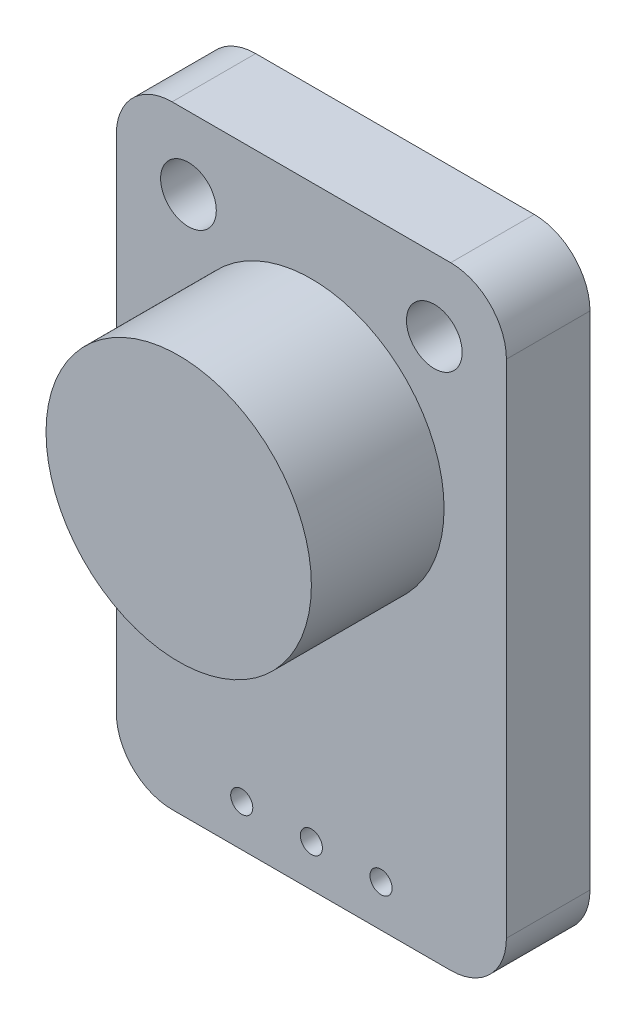
ISO-10303-21;
HEADER;
FILE_DESCRIPTION(('STEP AP214'),'2;1');
FILE_NAME('part.step','',(''),(''),'','','');
FILE_SCHEMA(('AUTOMOTIVE_DESIGN { 1 0 10303 214 1 1 1 1 }'));
ENDSEC;
DATA;
#1=APPLICATION_CONTEXT('core data for automotive mechanical design processes');
#2=APPLICATION_PROTOCOL_DEFINITION('international standard','automotive_design',2000,#1);
#3=PRODUCT_CONTEXT('',#1,'mechanical');
#4=PRODUCT('Part','Part','',(#3));
#5=PRODUCT_RELATED_PRODUCT_CATEGORY('part','',(#4));
#6=PRODUCT_DEFINITION_FORMATION('','',#4);
#7=PRODUCT_DEFINITION_CONTEXT('part definition',#1,'design');
#8=PRODUCT_DEFINITION('design','',#6,#7);
#9=PRODUCT_DEFINITION_SHAPE('','',#8);
#10=(LENGTH_UNIT() NAMED_UNIT(*) SI_UNIT(.MILLI.,.METRE.));
#11=(NAMED_UNIT(*) PLANE_ANGLE_UNIT() SI_UNIT($,.RADIAN.));
#12=(NAMED_UNIT(*) SI_UNIT($,.STERADIAN.) SOLID_ANGLE_UNIT());
#13=UNCERTAINTY_MEASURE_WITH_UNIT(LENGTH_MEASURE(1.E-05),#10,'distance_accuracy_value','');
#14=(GEOMETRIC_REPRESENTATION_CONTEXT(3) GLOBAL_UNCERTAINTY_ASSIGNED_CONTEXT((#13)) GLOBAL_UNIT_ASSIGNED_CONTEXT((#10,
#11,#12)) REPRESENTATION_CONTEXT('',''));
#15=CARTESIAN_POINT('',(0.,0.,0.));
#16=DIRECTION('',(0.,0.,1.));
#17=DIRECTION('',(1.,0.,0.));
#18=AXIS2_PLACEMENT_3D('',#15,#16,#17);
#19=CARTESIAN_POINT('',(0.,0.,4.7625));
#20=DIRECTION('',(0.,0.,-1.));
#21=DIRECTION('',(-1.,0.,0.));
#22=AXIS2_PLACEMENT_3D('',#19,#20,#21);
#23=CYLINDRICAL_SURFACE('',#22,4.7625);
#24=CARTESIAN_POINT('',(0.,0.,4.7625));
#25=DIRECTION('',(0.,0.,1.));
#26=DIRECTION('',(1.,0.,0.));
#27=AXIS2_PLACEMENT_3D('',#24,#25,#26);
#28=CIRCLE('',#27,4.7625);
#29=CARTESIAN_POINT('',(-4.7625,0.,4.7625));
#30=VERTEX_POINT('',#29);
#31=EDGE_CURVE('E160',#30,#30,#28,.T.);
#32=CARTESIAN_POINT('',(0.,0.,0.));
#33=DIRECTION('',(0.,0.,1.));
#34=DIRECTION('',(1.,0.,0.));
#35=AXIS2_PLACEMENT_3D('',#32,#33,#34);
#36=CIRCLE('',#35,4.7625);
#37=CARTESIAN_POINT('',(-4.7625,0.,0.));
#38=VERTEX_POINT('',#37);
#39=EDGE_CURVE('E164',#38,#38,#36,.T.);
#40=CARTESIAN_POINT('',(-4.7625,0.,4.7625));
#41=CARTESIAN_POINT('',(-4.7625,0.,4.712890625));
#42=CARTESIAN_POINT('',(-4.7625,0.,4.66328125));
#43=CARTESIAN_POINT('',(-4.7625,0.,4.5640625));
#44=CARTESIAN_POINT('',(-4.7625,0.,4.514453125));
#45=CARTESIAN_POINT('',(-4.7625,0.,4.415234375));
#46=CARTESIAN_POINT('',(-4.7625,0.,4.365625));
#47=CARTESIAN_POINT('',(-4.7625,0.,4.26640625));
#48=CARTESIAN_POINT('',(-4.7625,0.,4.216796875));
#49=CARTESIAN_POINT('',(-4.7625,0.,4.117578125));
#50=CARTESIAN_POINT('',(-4.7625,0.,4.06796875));
#51=CARTESIAN_POINT('',(-4.7625,0.,3.96875));
#52=CARTESIAN_POINT('',(-4.7625,0.,3.919140625));
#53=CARTESIAN_POINT('',(-4.7625,0.,3.819921875));
#54=CARTESIAN_POINT('',(-4.7625,0.,3.7703125));
#55=CARTESIAN_POINT('',(-4.7625,0.,3.67109375));
#56=CARTESIAN_POINT('',(-4.7625,0.,3.621484375));
#57=CARTESIAN_POINT('',(-4.7625,0.,3.522265625));
#58=CARTESIAN_POINT('',(-4.7625,0.,3.47265625));
#59=CARTESIAN_POINT('',(-4.7625,0.,3.3734375));
#60=CARTESIAN_POINT('',(-4.7625,0.,3.323828125));
#61=CARTESIAN_POINT('',(-4.7625,0.,3.224609375));
#62=CARTESIAN_POINT('',(-4.7625,0.,3.175));
#63=CARTESIAN_POINT('',(-4.7625,0.,3.07578125));
#64=CARTESIAN_POINT('',(-4.7625,0.,3.026171875));
#65=CARTESIAN_POINT('',(-4.7625,0.,2.926953125));
#66=CARTESIAN_POINT('',(-4.7625,0.,2.87734375));
#67=CARTESIAN_POINT('',(-4.7625,0.,2.778125));
#68=CARTESIAN_POINT('',(-4.7625,0.,2.728515625));
#69=CARTESIAN_POINT('',(-4.7625,0.,2.629296875));
#70=CARTESIAN_POINT('',(-4.7625,0.,2.5796875));
#71=CARTESIAN_POINT('',(-4.7625,0.,2.48046875));
#72=CARTESIAN_POINT('',(-4.7625,0.,2.430859375));
#73=CARTESIAN_POINT('',(-4.7625,0.,2.331640625));
#74=CARTESIAN_POINT('',(-4.7625,0.,2.28203125));
#75=CARTESIAN_POINT('',(-4.7625,0.,2.1828125));
#76=CARTESIAN_POINT('',(-4.7625,0.,2.133203125));
#77=CARTESIAN_POINT('',(-4.7625,0.,2.033984375));
#78=CARTESIAN_POINT('',(-4.7625,0.,1.984375));
#79=CARTESIAN_POINT('',(-4.7625,0.,1.88515625));
#80=CARTESIAN_POINT('',(-4.7625,0.,1.835546875));
#81=CARTESIAN_POINT('',(-4.7625,0.,1.736328125));
#82=CARTESIAN_POINT('',(-4.7625,0.,1.68671875));
#83=CARTESIAN_POINT('',(-4.7625,0.,1.5875));
#84=CARTESIAN_POINT('',(-4.7625,0.,1.537890625));
#85=CARTESIAN_POINT('',(-4.7625,0.,1.438671875));
#86=CARTESIAN_POINT('',(-4.7625,0.,1.3890625));
#87=CARTESIAN_POINT('',(-4.7625,0.,1.28984375));
#88=CARTESIAN_POINT('',(-4.7625,0.,1.240234375));
#89=CARTESIAN_POINT('',(-4.7625,0.,1.141015625));
#90=CARTESIAN_POINT('',(-4.7625,0.,1.09140625));
#91=CARTESIAN_POINT('',(-4.7625,0.,0.992187499999999));
#92=CARTESIAN_POINT('',(-4.7625,0.,0.942578124999999));
#93=CARTESIAN_POINT('',(-4.7625,0.,0.843359375));
#94=CARTESIAN_POINT('',(-4.7625,0.,0.79375));
#95=CARTESIAN_POINT('',(-4.7625,0.,0.69453125));
#96=CARTESIAN_POINT('',(-4.7625,0.,0.644921875));
#97=CARTESIAN_POINT('',(-4.7625,0.,0.545703125));
#98=CARTESIAN_POINT('',(-4.7625,0.,0.49609375));
#99=CARTESIAN_POINT('',(-4.7625,0.,0.396875));
#100=CARTESIAN_POINT('',(-4.7625,0.,0.347265625));
#101=CARTESIAN_POINT('',(-4.7625,0.,0.248046875));
#102=CARTESIAN_POINT('',(-4.7625,0.,0.1984375));
#103=CARTESIAN_POINT('',(-4.7625,0.,0.09921875));
#104=CARTESIAN_POINT('',(-4.7625,0.,0.049609375));
#105=CARTESIAN_POINT('',(-4.7625,0.,0.));
#106=B_SPLINE_CURVE_WITH_KNOTS('',3,(#40,#41,#42,#43,#44,#45,#46,#47,#48,#49,#50,#51,#52,#53,
#54,#55,#56,#57,#58,#59,#60,#61,#62,#63,#64,#65,#66,#67,#68,#69,#70,#71,#72,#73,#74,#75,#76,#77,
#78,#79,#80,#81,#82,#83,#84,#85,#86,#87,#88,#89,#90,#91,#92,#93,#94,#95,#96,#97,#98,#99,#100,
#101,#102,#103,#104,#105),.UNSPECIFIED.,.F.,.F.,(4,2,2,2,2,2,2,2,2,2,2,2,2,2,2,2,2,2,2,2,2,2,2,
2,2,2,2,2,2,2,2,2,4),(0.,0.148828125,0.29765625,0.446484375,0.5953125,0.744140625,
0.892968750000001,1.041796875,1.190625,1.339453125,1.48828125,1.637109375,1.7859375,1.934765625,
2.08359375,2.232421875,2.38125,2.530078125,2.67890625,2.827734375,2.9765625,3.125390625,
3.27421875,3.423046875,3.571875,3.720703125,3.86953125,4.018359375,4.1671875,4.316015625,
4.46484375,4.613671875,4.7625),.UNSPECIFIED.);
#107=EDGE_CURVE('BSEAM50',#30,#38,#106,.T.);
#108=ORIENTED_EDGE('',*,*,#31,.F.);
#109=ORIENTED_EDGE('',*,*,#39,.T.);
#110=ORIENTED_EDGE('',*,*,#107,.T.);
#111=ORIENTED_EDGE('',*,*,#107,.F.);
#112=EDGE_LOOP('',(#108,#110,#109,#111));
#113=FACE_BOUND('',#112,.T.);
#114=ADVANCED_FACE('F50',(#113),#23,.T.);
#115=CARTESIAN_POINT('',(0.,0.,4.7625));
#116=DIRECTION('',(0.,0.,1.));
#117=DIRECTION('',(1.,0.,0.));
#118=AXIS2_PLACEMENT_3D('',#115,#116,#117);
#119=PLANE('',#118);
#120=ORIENTED_EDGE('',*,*,#31,.T.);
#121=EDGE_LOOP('',(#120));
#122=FACE_BOUND('',#121,.T.);
#123=ADVANCED_FACE('F276',(#122),#119,.T.);
#124=CARTESIAN_POINT('',(0.,-14.2375,-3.));
#125=DIRECTION('',(0.,-1.,0.));
#126=DIRECTION('',(0.,0.,-1.));
#127=AXIS2_PLACEMENT_3D('',#124,#125,#126);
#128=PLANE('',#127);
#129=DIRECTION('',(1.,0.,0.));
#130=VECTOR('',#129,1.);
#131=CARTESIAN_POINT('',(0.,-14.2375,0.));
#132=LINE('',#131,#130);
#133=CARTESIAN_POINT('',(-5.00000000000001,-14.2375,0.));
#134=VERTEX_POINT('',#133);
#135=CARTESIAN_POINT('',(4.99999999999999,-14.2375,0.));
#136=VERTEX_POINT('',#135);
#137=EDGE_CURVE('E222',#134,#136,#132,.T.);
#138=ORIENTED_EDGE('',*,*,#137,.F.);
#139=DIRECTION('',(0.,0.,1.));
#140=VECTOR('',#139,1.);
#141=CARTESIAN_POINT('',(-5.00000000000001,-14.2375,-3.));
#142=LINE('',#141,#140);
#143=CARTESIAN_POINT('',(-5.00000000000001,-14.2375,-3.));
#144=VERTEX_POINT('',#143);
#145=EDGE_CURVE('E123',#134,#144,#142,.F.);
#146=ORIENTED_EDGE('',*,*,#145,.T.);
#147=DIRECTION('',(1.,0.,0.));
#148=VECTOR('',#147,1.);
#149=CARTESIAN_POINT('',(0.,-14.2375,-3.));
#150=LINE('',#149,#148);
#151=CARTESIAN_POINT('',(4.99999999999999,-14.2375,-3.));
#152=VERTEX_POINT('',#151);
#153=EDGE_CURVE('E147',#144,#152,#150,.T.);
#154=ORIENTED_EDGE('',*,*,#153,.T.);
#155=DIRECTION('',(0.,0.,1.));
#156=VECTOR('',#155,1.);
#157=CARTESIAN_POINT('',(4.99999999999999,-14.2375,-3.));
#158=LINE('',#157,#156);
#159=EDGE_CURVE('E129',#152,#136,#158,.T.);
#160=ORIENTED_EDGE('',*,*,#159,.T.);
#161=EDGE_LOOP('',(#138,#146,#154,#160));
#162=FACE_BOUND('',#161,.T.);
#163=ADVANCED_FACE('F282',(#162),#128,.T.);
#164=CARTESIAN_POINT('',(-7.00000000000001,0.,-3.));
#165=DIRECTION('',(1.,0.,0.));
#166=DIRECTION('',(0.,0.,-1.));
#167=AXIS2_PLACEMENT_3D('',#164,#165,#166);
#168=PLANE('',#167);
#169=DIRECTION('',(0.,1.,0.));
#170=VECTOR('',#169,1.);
#171=CARTESIAN_POINT('',(-7.00000000000001,0.,-3.));
#172=LINE('',#171,#170);
#173=CARTESIAN_POINT('',(-7.00000000000001,-12.2375,-3.));
#174=VERTEX_POINT('',#173);
#175=CARTESIAN_POINT('',(-7.00000000000001,5.7625,-3.));
#176=VERTEX_POINT('',#175);
#177=EDGE_CURVE('E139',#174,#176,#172,.T.);
#178=ORIENTED_EDGE('',*,*,#177,.F.);
#179=DIRECTION('',(0.,0.,1.));
#180=VECTOR('',#179,1.);
#181=CARTESIAN_POINT('',(-7.00000000000001,-12.2375,0.));
#182=LINE('',#181,#180);
#183=CARTESIAN_POINT('',(-7.00000000000001,-12.2375,0.));
#184=VERTEX_POINT('',#183);
#185=EDGE_CURVE('E122',#174,#184,#182,.T.);
#186=ORIENTED_EDGE('',*,*,#185,.T.);
#187=DIRECTION('',(0.,1.,0.));
#188=VECTOR('',#187,1.);
#189=CARTESIAN_POINT('',(-7.00000000000001,0.,0.));
#190=LINE('',#189,#188);
#191=CARTESIAN_POINT('',(-7.00000000000001,5.7625,0.));
#192=VERTEX_POINT('',#191);
#193=EDGE_CURVE('E136',#184,#192,#190,.T.);
#194=ORIENTED_EDGE('',*,*,#193,.T.);
#195=DIRECTION('',(0.,0.,1.));
#196=VECTOR('',#195,1.);
#197=CARTESIAN_POINT('',(-7.00000000000001,5.7625,-3.));
#198=LINE('',#197,#196);
#199=EDGE_CURVE('E142',#192,#176,#198,.F.);
#200=ORIENTED_EDGE('',*,*,#199,.T.);
#201=EDGE_LOOP('',(#178,#186,#194,#200));
#202=FACE_BOUND('',#201,.T.);
#203=ADVANCED_FACE('F135',(#202),#168,.F.);
#204=CARTESIAN_POINT('',(0.,7.7625,-3.));
#205=DIRECTION('',(0.,-1.,0.));
#206=DIRECTION('',(0.,0.,-1.));
#207=AXIS2_PLACEMENT_3D('',#204,#205,#206);
#208=PLANE('',#207);
#209=DIRECTION('',(1.,0.,0.));
#210=VECTOR('',#209,1.);
#211=CARTESIAN_POINT('',(0.,7.7625,-3.));
#212=LINE('',#211,#210);
#213=CARTESIAN_POINT('',(-5.00000000000001,7.7625,-3.));
#214=VERTEX_POINT('',#213);
#215=CARTESIAN_POINT('',(5.,7.7625,-3.));
#216=VERTEX_POINT('',#215);
#217=EDGE_CURVE('E232',#214,#216,#212,.T.);
#218=ORIENTED_EDGE('',*,*,#217,.F.);
#219=DIRECTION('',(0.,0.,1.));
#220=VECTOR('',#219,1.);
#221=CARTESIAN_POINT('',(-5.00000000000001,7.7625,-3.));
#222=LINE('',#221,#220);
#223=CARTESIAN_POINT('',(-5.00000000000001,7.7625,0.));
#224=VERTEX_POINT('',#223);
#225=EDGE_CURVE('E196',#214,#224,#222,.T.);
#226=ORIENTED_EDGE('',*,*,#225,.T.);
#227=DIRECTION('',(1.,0.,0.));
#228=VECTOR('',#227,1.);
#229=CARTESIAN_POINT('',(0.,7.7625,0.));
#230=LINE('',#229,#228);
#231=CARTESIAN_POINT('',(5.,7.7625,0.));
#232=VERTEX_POINT('',#231);
#233=EDGE_CURVE('E148',#224,#232,#230,.T.);
#234=ORIENTED_EDGE('',*,*,#233,.T.);
#235=DIRECTION('',(0.,0.,1.));
#236=VECTOR('',#235,1.);
#237=CARTESIAN_POINT('',(5.,7.7625,-3.));
#238=LINE('',#237,#236);
#239=EDGE_CURVE('E193',#232,#216,#238,.F.);
#240=ORIENTED_EDGE('',*,*,#239,.T.);
#241=EDGE_LOOP('',(#218,#226,#234,#240));
#242=FACE_BOUND('',#241,.T.);
#243=ADVANCED_FACE('F310',(#242),#208,.F.);
#244=CARTESIAN_POINT('',(7.,0.,-3.));
#245=DIRECTION('',(1.,0.,0.));
#246=DIRECTION('',(0.,1.,0.));
#247=AXIS2_PLACEMENT_3D('',#244,#245,#246);
#248=PLANE('',#247);
#249=DIRECTION('',(0.,1.,0.));
#250=VECTOR('',#249,1.);
#251=CARTESIAN_POINT('',(7.,0.,0.));
#252=LINE('',#251,#250);
#253=CARTESIAN_POINT('',(6.99999999999999,-12.2375,0.));
#254=VERTEX_POINT('',#253);
#255=CARTESIAN_POINT('',(7.,5.7625,0.));
#256=VERTEX_POINT('',#255);
#257=EDGE_CURVE('E156',#254,#256,#252,.T.);
#258=ORIENTED_EDGE('',*,*,#257,.F.);
#259=DIRECTION('',(0.,0.,1.));
#260=VECTOR('',#259,1.);
#261=CARTESIAN_POINT('',(6.99999999999999,-12.2375,-3.));
#262=LINE('',#261,#260);
#263=CARTESIAN_POINT('',(6.99999999999999,-12.2375,-3.));
#264=VERTEX_POINT('',#263);
#265=EDGE_CURVE('E11',#254,#264,#262,.F.);
#266=ORIENTED_EDGE('',*,*,#265,.T.);
#267=DIRECTION('',(0.,1.,0.));
#268=VECTOR('',#267,1.);
#269=CARTESIAN_POINT('',(7.,0.,-3.));
#270=LINE('',#269,#268);
#271=CARTESIAN_POINT('',(7.,5.7625,-3.));
#272=VERTEX_POINT('',#271);
#273=EDGE_CURVE('E153',#264,#272,#270,.T.);
#274=ORIENTED_EDGE('',*,*,#273,.T.);
#275=DIRECTION('',(0.,0.,1.));
#276=VECTOR('',#275,1.);
#277=CARTESIAN_POINT('',(7.,5.7625,0.));
#278=LINE('',#277,#276);
#279=EDGE_CURVE('E60',#272,#256,#278,.T.);
#280=ORIENTED_EDGE('',*,*,#279,.T.);
#281=EDGE_LOOP('',(#258,#266,#274,#280));
#282=FACE_BOUND('',#281,.T.);
#283=ADVANCED_FACE('F313',(#282),#248,.T.);
#284=CARTESIAN_POINT('',(0.,0.,-3.));
#285=DIRECTION('',(0.,0.,1.));
#286=DIRECTION('',(1.,0.,0.));
#287=AXIS2_PLACEMENT_3D('',#284,#285,#286);
#288=PLANE('',#287);
#289=CARTESIAN_POINT('',(4.41250000000001,5.175,-3.));
#290=DIRECTION('',(0.,0.,1.));
#291=DIRECTION('',(1.,0.,0.));
#292=AXIS2_PLACEMENT_3D('',#289,#290,#291);
#293=CIRCLE('',#292,1.);
#294=CARTESIAN_POINT('',(5.41250000000001,5.175,-3.));
#295=VERTEX_POINT('',#294);
#296=EDGE_CURVE('E241',#295,#295,#293,.T.);
#297=ORIENTED_EDGE('',*,*,#296,.T.);
#298=EDGE_LOOP('',(#297));
#299=FACE_BOUND('',#298,.T.);
#300=CARTESIAN_POINT('',(-4.41250000000001,5.175,-3.));
#301=DIRECTION('',(0.,0.,1.));
#302=DIRECTION('',(1.,0.,0.));
#303=AXIS2_PLACEMENT_3D('',#300,#301,#302);
#304=CIRCLE('',#303,1.);
#305=CARTESIAN_POINT('',(-3.41250000000001,5.175,-3.));
#306=VERTEX_POINT('',#305);
#307=EDGE_CURVE('E245',#306,#306,#304,.T.);
#308=ORIENTED_EDGE('',*,*,#307,.T.);
#309=EDGE_LOOP('',(#308));
#310=FACE_BOUND('',#309,.T.);
#311=CARTESIAN_POINT('',(-2.5,-12.7375,-3.));
#312=DIRECTION('',(0.,0.,1.));
#313=DIRECTION('',(1.,0.,0.));
#314=AXIS2_PLACEMENT_3D('',#311,#312,#313);
#315=CIRCLE('',#314,0.396875);
#316=CARTESIAN_POINT('',(-2.103125,-12.7375,-3.));
#317=VERTEX_POINT('',#316);
#318=EDGE_CURVE('E249',#317,#317,#315,.T.);
#319=ORIENTED_EDGE('',*,*,#318,.T.);
#320=EDGE_LOOP('',(#319));
#321=FACE_BOUND('',#320,.T.);
#322=CARTESIAN_POINT('',(2.5,-12.7375,-3.));
#323=DIRECTION('',(0.,0.,1.));
#324=DIRECTION('',(1.,0.,0.));
#325=AXIS2_PLACEMENT_3D('',#322,#323,#324);
#326=CIRCLE('',#325,0.396875);
#327=CARTESIAN_POINT('',(2.896875,-12.7375,-3.));
#328=VERTEX_POINT('',#327);
#329=EDGE_CURVE('E240',#328,#328,#326,.T.);
#330=ORIENTED_EDGE('',*,*,#329,.T.);
#331=EDGE_LOOP('',(#330));
#332=FACE_BOUND('',#331,.T.);
#333=CARTESIAN_POINT('',(0.,-12.7375,-3.));
#334=DIRECTION('',(0.,0.,1.));
#335=DIRECTION('',(1.,0.,0.));
#336=AXIS2_PLACEMENT_3D('',#333,#334,#335);
#337=CIRCLE('',#336,0.396875);
#338=CARTESIAN_POINT('',(0.396875,-12.7375,-3.));
#339=VERTEX_POINT('',#338);
#340=EDGE_CURVE('E208',#339,#339,#337,.T.);
#341=ORIENTED_EDGE('',*,*,#340,.T.);
#342=EDGE_LOOP('',(#341));
#343=FACE_BOUND('',#342,.T.);
#344=ORIENTED_EDGE('',*,*,#153,.F.);
#345=CARTESIAN_POINT('',(-5.00000000000001,-12.2375,-3.));
#346=DIRECTION('',(0.,0.,1.));
#347=DIRECTION('',(1.,0.,0.));
#348=AXIS2_PLACEMENT_3D('',#345,#346,#347);
#349=CIRCLE('',#348,2.);
#350=EDGE_CURVE('E190',#144,#174,#349,.F.);
#351=ORIENTED_EDGE('',*,*,#350,.T.);
#352=ORIENTED_EDGE('',*,*,#177,.T.);
#353=CARTESIAN_POINT('',(-5.00000000000001,5.7625,-3.));
#354=DIRECTION('',(0.,0.,1.));
#355=DIRECTION('',(1.,0.,0.));
#356=AXIS2_PLACEMENT_3D('',#353,#354,#355);
#357=CIRCLE('',#356,2.);
#358=EDGE_CURVE('E187',#176,#214,#357,.F.);
#359=ORIENTED_EDGE('',*,*,#358,.T.);
#360=ORIENTED_EDGE('',*,*,#217,.T.);
#361=CARTESIAN_POINT('',(5.,5.7625,-3.));
#362=DIRECTION('',(0.,0.,1.));
#363=DIRECTION('',(1.,0.,0.));
#364=AXIS2_PLACEMENT_3D('',#361,#362,#363);
#365=CIRCLE('',#364,2.);
#366=EDGE_CURVE('E68',#216,#272,#365,.F.);
#367=ORIENTED_EDGE('',*,*,#366,.T.);
#368=ORIENTED_EDGE('',*,*,#273,.F.);
#369=CARTESIAN_POINT('',(4.99999999999999,-12.2375,-3.));
#370=DIRECTION('',(0.,0.,1.));
#371=DIRECTION('',(1.,0.,0.));
#372=AXIS2_PLACEMENT_3D('',#369,#370,#371);
#373=CIRCLE('',#372,2.);
#374=EDGE_CURVE('E184',#264,#152,#373,.F.);
#375=ORIENTED_EDGE('',*,*,#374,.T.);
#376=EDGE_LOOP('',(#344,#351,#352,#359,#360,#367,#368,#375));
#377=FACE_BOUND('',#376,.T.);
#378=ADVANCED_FACE('F257',(#299,#310,#321,#332,#343,#377),#288,.F.);
#379=CARTESIAN_POINT('',(0.,0.,0.));
#380=DIRECTION('',(0.,0.,1.));
#381=DIRECTION('',(1.,0.,0.));
#382=AXIS2_PLACEMENT_3D('',#379,#380,#381);
#383=PLANE('',#382);
#384=CARTESIAN_POINT('',(4.41250000000001,5.175,0.));
#385=DIRECTION('',(0.,0.,1.));
#386=DIRECTION('',(1.,0.,0.));
#387=AXIS2_PLACEMENT_3D('',#384,#385,#386);
#388=CIRCLE('',#387,1.);
#389=CARTESIAN_POINT('',(5.41250000000001,5.175,0.));
#390=VERTEX_POINT('',#389);
#391=EDGE_CURVE('E54',#390,#390,#388,.T.);
#392=ORIENTED_EDGE('',*,*,#391,.F.);
#393=EDGE_LOOP('',(#392));
#394=FACE_BOUND('',#393,.T.);
#395=CARTESIAN_POINT('',(-4.41250000000001,5.175,0.));
#396=DIRECTION('',(0.,0.,1.));
#397=DIRECTION('',(1.,0.,0.));
#398=AXIS2_PLACEMENT_3D('',#395,#396,#397);
#399=CIRCLE('',#398,1.);
#400=CARTESIAN_POINT('',(-3.41250000000001,5.175,0.));
#401=VERTEX_POINT('',#400);
#402=EDGE_CURVE('E215',#401,#401,#399,.T.);
#403=ORIENTED_EDGE('',*,*,#402,.F.);
#404=EDGE_LOOP('',(#403));
#405=FACE_BOUND('',#404,.T.);
#406=CARTESIAN_POINT('',(-2.5,-12.7375,0.));
#407=DIRECTION('',(0.,0.,1.));
#408=DIRECTION('',(1.,0.,0.));
#409=AXIS2_PLACEMENT_3D('',#406,#407,#408);
#410=CIRCLE('',#409,0.396875);
#411=CARTESIAN_POINT('',(-2.103125,-12.7375,0.));
#412=VERTEX_POINT('',#411);
#413=EDGE_CURVE('E212',#412,#412,#410,.T.);
#414=ORIENTED_EDGE('',*,*,#413,.F.);
#415=EDGE_LOOP('',(#414));
#416=FACE_BOUND('',#415,.T.);
#417=CARTESIAN_POINT('',(2.5,-12.7375,0.));
#418=DIRECTION('',(0.,0.,1.));
#419=DIRECTION('',(1.,0.,0.));
#420=AXIS2_PLACEMENT_3D('',#417,#418,#419);
#421=CIRCLE('',#420,0.396875);
#422=CARTESIAN_POINT('',(2.896875,-12.7375,0.));
#423=VERTEX_POINT('',#422);
#424=EDGE_CURVE('E207',#423,#423,#421,.T.);
#425=ORIENTED_EDGE('',*,*,#424,.F.);
#426=EDGE_LOOP('',(#425));
#427=FACE_BOUND('',#426,.T.);
#428=CARTESIAN_POINT('',(0.,-12.7375,0.));
#429=DIRECTION('',(0.,0.,1.));
#430=DIRECTION('',(1.,0.,0.));
#431=AXIS2_PLACEMENT_3D('',#428,#429,#430);
#432=CIRCLE('',#431,0.396875);
#433=CARTESIAN_POINT('',(0.396875,-12.7375,0.));
#434=VERTEX_POINT('',#433);
#435=EDGE_CURVE('E203',#434,#434,#432,.T.);
#436=ORIENTED_EDGE('',*,*,#435,.F.);
#437=EDGE_LOOP('',(#436));
#438=FACE_BOUND('',#437,.T.);
#439=ORIENTED_EDGE('',*,*,#39,.F.);
#440=EDGE_LOOP('',(#439));
#441=FACE_BOUND('',#440,.T.);
#442=ORIENTED_EDGE('',*,*,#193,.F.);
#443=CARTESIAN_POINT('',(-5.00000000000001,-12.2375,0.));
#444=DIRECTION('',(0.,0.,1.));
#445=DIRECTION('',(1.,0.,0.));
#446=AXIS2_PLACEMENT_3D('',#443,#444,#445);
#447=CIRCLE('',#446,2.);
#448=EDGE_CURVE('E118',#184,#134,#447,.T.);
#449=ORIENTED_EDGE('',*,*,#448,.T.);
#450=ORIENTED_EDGE('',*,*,#137,.T.);
#451=CARTESIAN_POINT('',(4.99999999999999,-12.2375,0.));
#452=DIRECTION('',(0.,0.,1.));
#453=DIRECTION('',(1.,0.,0.));
#454=AXIS2_PLACEMENT_3D('',#451,#452,#453);
#455=CIRCLE('',#454,2.);
#456=EDGE_CURVE('E172',#136,#254,#455,.T.);
#457=ORIENTED_EDGE('',*,*,#456,.T.);
#458=ORIENTED_EDGE('',*,*,#257,.T.);
#459=CARTESIAN_POINT('',(5.,5.7625,0.));
#460=DIRECTION('',(0.,0.,1.));
#461=DIRECTION('',(1.,0.,0.));
#462=AXIS2_PLACEMENT_3D('',#459,#460,#461);
#463=CIRCLE('',#462,2.);
#464=EDGE_CURVE('E141',#256,#232,#463,.T.);
#465=ORIENTED_EDGE('',*,*,#464,.T.);
#466=ORIENTED_EDGE('',*,*,#233,.F.);
#467=CARTESIAN_POINT('',(-5.00000000000001,5.7625,0.));
#468=DIRECTION('',(0.,0.,1.));
#469=DIRECTION('',(1.,0.,0.));
#470=AXIS2_PLACEMENT_3D('',#467,#468,#469);
#471=CIRCLE('',#470,2.);
#472=EDGE_CURVE('E130',#224,#192,#471,.T.);
#473=ORIENTED_EDGE('',*,*,#472,.T.);
#474=EDGE_LOOP('',(#442,#449,#450,#457,#458,#465,#466,#473));
#475=FACE_BOUND('',#474,.T.);
#476=ADVANCED_FACE('F144',(#394,#405,#416,#427,#438,#441,#475),#383,.T.);
#477=CARTESIAN_POINT('',(-5.00000000000001,-12.2375,-3.));
#478=DIRECTION('',(0.,0.,-1.));
#479=DIRECTION('',(-1.,0.,0.));
#480=AXIS2_PLACEMENT_3D('',#477,#478,#479);
#481=CYLINDRICAL_SURFACE('',#480,2.);
#482=ORIENTED_EDGE('',*,*,#350,.F.);
#483=ORIENTED_EDGE('',*,*,#145,.F.);
#484=ORIENTED_EDGE('',*,*,#448,.F.);
#485=ORIENTED_EDGE('',*,*,#185,.F.);
#486=EDGE_LOOP('',(#482,#483,#484,#485));
#487=FACE_BOUND('',#486,.T.);
#488=ADVANCED_FACE('F121',(#487),#481,.T.);
#489=CARTESIAN_POINT('',(-5.00000000000001,5.7625,-3.));
#490=DIRECTION('',(0.,0.,1.));
#491=DIRECTION('',(1.,0.,0.));
#492=AXIS2_PLACEMENT_3D('',#489,#490,#491);
#493=CYLINDRICAL_SURFACE('',#492,2.);
#494=ORIENTED_EDGE('',*,*,#358,.F.);
#495=ORIENTED_EDGE('',*,*,#199,.F.);
#496=ORIENTED_EDGE('',*,*,#472,.F.);
#497=ORIENTED_EDGE('',*,*,#225,.F.);
#498=EDGE_LOOP('',(#494,#495,#496,#497));
#499=FACE_BOUND('',#498,.T.);
#500=ADVANCED_FACE('F291',(#499),#493,.T.);
#501=CARTESIAN_POINT('',(4.99999999999999,-12.2375,-3.));
#502=DIRECTION('',(0.,0.,1.));
#503=DIRECTION('',(1.,0.,0.));
#504=AXIS2_PLACEMENT_3D('',#501,#502,#503);
#505=CYLINDRICAL_SURFACE('',#504,2.);
#506=ORIENTED_EDGE('',*,*,#374,.F.);
#507=ORIENTED_EDGE('',*,*,#265,.F.);
#508=ORIENTED_EDGE('',*,*,#456,.F.);
#509=ORIENTED_EDGE('',*,*,#159,.F.);
#510=EDGE_LOOP('',(#506,#507,#508,#509));
#511=FACE_BOUND('',#510,.T.);
#512=ADVANCED_FACE('F293',(#511),#505,.T.);
#513=CARTESIAN_POINT('',(5.,5.7625,-3.));
#514=DIRECTION('',(0.,0.,-1.));
#515=DIRECTION('',(-1.,0.,0.));
#516=AXIS2_PLACEMENT_3D('',#513,#514,#515);
#517=CYLINDRICAL_SURFACE('',#516,2.);
#518=ORIENTED_EDGE('',*,*,#366,.F.);
#519=ORIENTED_EDGE('',*,*,#239,.F.);
#520=ORIENTED_EDGE('',*,*,#464,.F.);
#521=ORIENTED_EDGE('',*,*,#279,.F.);
#522=EDGE_LOOP('',(#518,#519,#520,#521));
#523=FACE_BOUND('',#522,.T.);
#524=ADVANCED_FACE('F52',(#523),#517,.T.);
#525=CARTESIAN_POINT('',(0.,-12.7375,-3.));
#526=DIRECTION('',(0.,0.,1.));
#527=DIRECTION('',(1.,0.,0.));
#528=AXIS2_PLACEMENT_3D('',#525,#526,#527);
#529=CYLINDRICAL_SURFACE('',#528,0.396875);
#530=ORIENTED_EDGE('',*,*,#435,.T.);
#531=EDGE_LOOP('',(#530));
#532=FACE_BOUND('',#531,.T.);
#533=ORIENTED_EDGE('',*,*,#340,.F.);
#534=EDGE_LOOP('',(#533));
#535=FACE_BOUND('',#534,.T.);
#536=ADVANCED_FACE('F263',(#532,#535),#529,.F.);
#537=CARTESIAN_POINT('',(2.5,-12.7375,-3.));
#538=DIRECTION('',(0.,0.,1.));
#539=DIRECTION('',(1.,0.,0.));
#540=AXIS2_PLACEMENT_3D('',#537,#538,#539);
#541=CYLINDRICAL_SURFACE('',#540,0.396875);
#542=ORIENTED_EDGE('',*,*,#424,.T.);
#543=EDGE_LOOP('',(#542));
#544=FACE_BOUND('',#543,.T.);
#545=ORIENTED_EDGE('',*,*,#329,.F.);
#546=EDGE_LOOP('',(#545));
#547=FACE_BOUND('',#546,.T.);
#548=ADVANCED_FACE('F260',(#544,#547),#541,.F.);
#549=CARTESIAN_POINT('',(-2.5,-12.7375,-3.));
#550=DIRECTION('',(0.,0.,1.));
#551=DIRECTION('',(1.,0.,0.));
#552=AXIS2_PLACEMENT_3D('',#549,#550,#551);
#553=CYLINDRICAL_SURFACE('',#552,0.396875);
#554=ORIENTED_EDGE('',*,*,#413,.T.);
#555=EDGE_LOOP('',(#554));
#556=FACE_BOUND('',#555,.T.);
#557=ORIENTED_EDGE('',*,*,#318,.F.);
#558=EDGE_LOOP('',(#557));
#559=FACE_BOUND('',#558,.T.);
#560=ADVANCED_FACE('F262',(#556,#559),#553,.F.);
#561=CARTESIAN_POINT('',(-4.41250000000001,5.175,-3.));
#562=DIRECTION('',(0.,0.,1.));
#563=DIRECTION('',(1.,0.,0.));
#564=AXIS2_PLACEMENT_3D('',#561,#562,#563);
#565=CYLINDRICAL_SURFACE('',#564,1.);
#566=ORIENTED_EDGE('',*,*,#402,.T.);
#567=EDGE_LOOP('',(#566));
#568=FACE_BOUND('',#567,.T.);
#569=ORIENTED_EDGE('',*,*,#307,.F.);
#570=EDGE_LOOP('',(#569));
#571=FACE_BOUND('',#570,.T.);
#572=ADVANCED_FACE('F270',(#568,#571),#565,.F.);
#573=CARTESIAN_POINT('',(4.41250000000001,5.175,-3.));
#574=DIRECTION('',(0.,0.,1.));
#575=DIRECTION('',(1.,0.,0.));
#576=AXIS2_PLACEMENT_3D('',#573,#574,#575);
#577=CYLINDRICAL_SURFACE('',#576,1.);
#578=ORIENTED_EDGE('',*,*,#391,.T.);
#579=EDGE_LOOP('',(#578));
#580=FACE_BOUND('',#579,.T.);
#581=ORIENTED_EDGE('',*,*,#296,.F.);
#582=EDGE_LOOP('',(#581));
#583=FACE_BOUND('',#582,.T.);
#584=ADVANCED_FACE('F325',(#580,#583),#577,.F.);
#585=CLOSED_SHELL('',(#114,#123,#163,#203,#243,#283,#378,#476,#488,#500,#512,#524,#536,#548,
#560,#572,#584));
#586=MANIFOLD_SOLID_BREP('B2',#585);
#587=ADVANCED_BREP_SHAPE_REPRESENTATION('',(#18,#586),#14);
#588=SHAPE_DEFINITION_REPRESENTATION(#9,#587);
ENDSEC;
END-ISO-10303-21;
